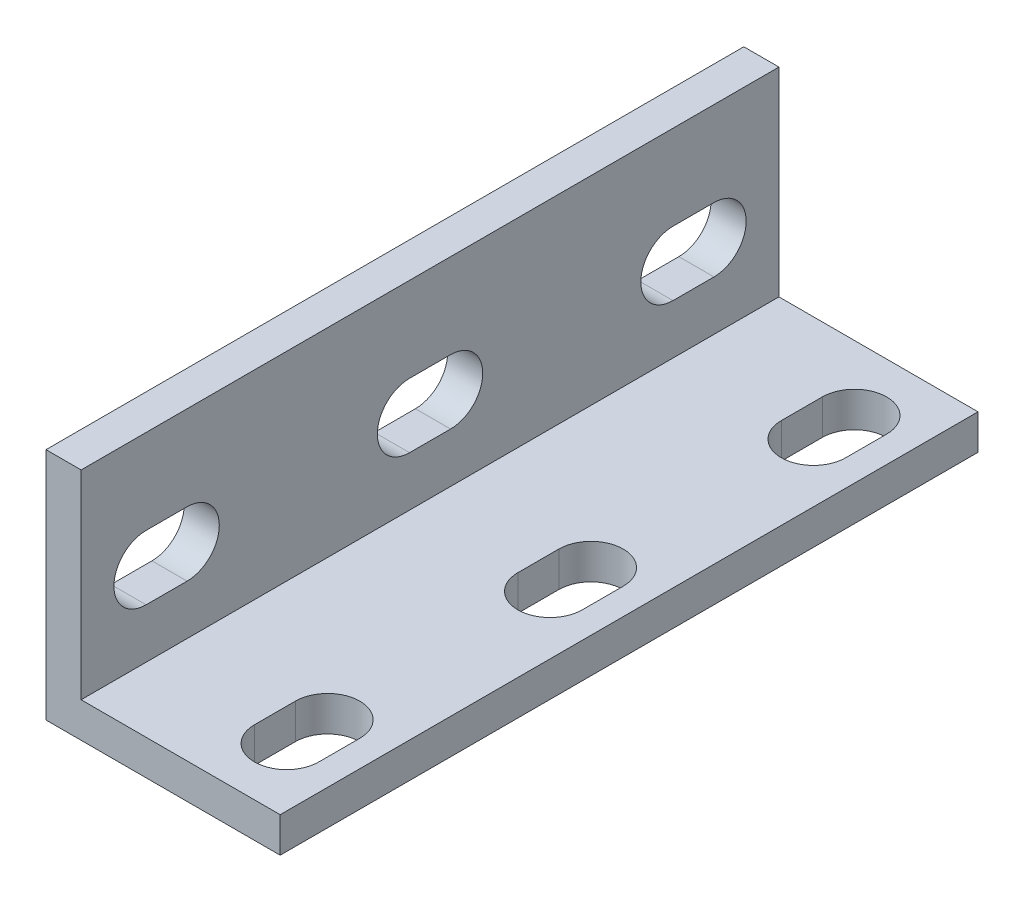
ISO-10303-21;
HEADER;
FILE_DESCRIPTION(('STEP AP214'),'2;1');
FILE_NAME('part.step','',(''),(''),'','','');
FILE_SCHEMA(('AUTOMOTIVE_DESIGN { 1 0 10303 214 1 1 1 1 }'));
ENDSEC;
DATA;
#1=APPLICATION_CONTEXT('core data for automotive mechanical design processes');
#2=APPLICATION_PROTOCOL_DEFINITION('international standard','automotive_design',2000,#1);
#3=PRODUCT_CONTEXT('',#1,'mechanical');
#4=PRODUCT('Part','Part','',(#3));
#5=PRODUCT_RELATED_PRODUCT_CATEGORY('part','',(#4));
#6=PRODUCT_DEFINITION_FORMATION('','',#4);
#7=PRODUCT_DEFINITION_CONTEXT('part definition',#1,'design');
#8=PRODUCT_DEFINITION('design','',#6,#7);
#9=PRODUCT_DEFINITION_SHAPE('','',#8);
#10=(LENGTH_UNIT() NAMED_UNIT(*) SI_UNIT(.MILLI.,.METRE.));
#11=(NAMED_UNIT(*) PLANE_ANGLE_UNIT() SI_UNIT($,.RADIAN.));
#12=(NAMED_UNIT(*) SI_UNIT($,.STERADIAN.) SOLID_ANGLE_UNIT());
#13=UNCERTAINTY_MEASURE_WITH_UNIT(LENGTH_MEASURE(1.E-05),#10,'distance_accuracy_value','');
#14=(GEOMETRIC_REPRESENTATION_CONTEXT(3) GLOBAL_UNCERTAINTY_ASSIGNED_CONTEXT((#13)) GLOBAL_UNIT_ASSIGNED_CONTEXT((#10,
#11,#12)) REPRESENTATION_CONTEXT('',''));
#15=CARTESIAN_POINT('',(0.,0.,0.));
#16=DIRECTION('',(0.,0.,1.));
#17=DIRECTION('',(1.,0.,0.));
#18=AXIS2_PLACEMENT_3D('',#15,#16,#17);
#19=CARTESIAN_POINT('',(0.,0.,59.6));
#20=DIRECTION('',(0.,1.,0.));
#21=DIRECTION('',(0.,0.,1.));
#22=AXIS2_PLACEMENT_3D('',#19,#20,#21);
#23=PLANE('',#22);
#24=DIRECTION('',(0.,0.,-1.));
#25=VECTOR('',#24,1.);
#26=CARTESIAN_POINT('',(17.75,0.,28.05));
#27=LINE('',#26,#25);
#28=CARTESIAN_POINT('',(17.75,0.,31.55));
#29=VERTEX_POINT('',#28);
#30=CARTESIAN_POINT('',(17.75,0.,28.05));
#31=VERTEX_POINT('',#30);
#32=EDGE_CURVE('E238',#29,#31,#27,.T.);
#33=ORIENTED_EDGE('',*,*,#32,.T.);
#34=CARTESIAN_POINT('',(15.,0.,28.05));
#35=DIRECTION('',(0.,1.,0.));
#36=DIRECTION('',(0.,0.,1.));
#37=AXIS2_PLACEMENT_3D('',#34,#35,#36);
#38=CIRCLE('',#37,2.75000000000001);
#39=CARTESIAN_POINT('',(12.25,0.,28.05));
#40=VERTEX_POINT('',#39);
#41=EDGE_CURVE('E232',#31,#40,#38,.T.);
#42=ORIENTED_EDGE('',*,*,#41,.T.);
#43=DIRECTION('',(0.,0.,1.));
#44=VECTOR('',#43,1.);
#45=CARTESIAN_POINT('',(12.25,0.,28.05));
#46=LINE('',#45,#44);
#47=CARTESIAN_POINT('',(12.25,0.,31.55));
#48=VERTEX_POINT('',#47);
#49=EDGE_CURVE('E241',#40,#48,#46,.T.);
#50=ORIENTED_EDGE('',*,*,#49,.T.);
#51=CARTESIAN_POINT('',(15.,0.,31.55));
#52=DIRECTION('',(0.,1.,0.));
#53=DIRECTION('',(0.,0.,1.));
#54=AXIS2_PLACEMENT_3D('',#51,#52,#53);
#55=CIRCLE('',#54,2.75000000000001);
#56=EDGE_CURVE('E49',#48,#29,#55,.T.);
#57=ORIENTED_EDGE('',*,*,#56,.T.);
#58=EDGE_LOOP('',(#33,#42,#50,#57));
#59=FACE_BOUND('',#58,.T.);
#60=DIRECTION('',(0.,0.,-1.));
#61=VECTOR('',#60,1.);
#62=CARTESIAN_POINT('',(17.75,0.,5.54999999999999));
#63=LINE('',#62,#61);
#64=CARTESIAN_POINT('',(17.75,0.,9.05000000000001));
#65=VERTEX_POINT('',#64);
#66=CARTESIAN_POINT('',(17.75,0.,5.54999999999999));
#67=VERTEX_POINT('',#66);
#68=EDGE_CURVE('E276',#65,#67,#63,.T.);
#69=ORIENTED_EDGE('',*,*,#68,.T.);
#70=CARTESIAN_POINT('',(15.,0.,5.55));
#71=DIRECTION('',(0.,1.,0.));
#72=DIRECTION('',(0.,0.,-1.));
#73=AXIS2_PLACEMENT_3D('',#70,#71,#72);
#74=CIRCLE('',#73,2.75000000000001);
#75=CARTESIAN_POINT('',(12.25,0.,5.54999999999999));
#76=VERTEX_POINT('',#75);
#77=EDGE_CURVE('E266',#67,#76,#74,.T.);
#78=ORIENTED_EDGE('',*,*,#77,.T.);
#79=DIRECTION('',(0.,0.,1.));
#80=VECTOR('',#79,1.);
#81=CARTESIAN_POINT('',(12.25,0.,5.54999999999999));
#82=LINE('',#81,#80);
#83=CARTESIAN_POINT('',(12.25,0.,9.05));
#84=VERTEX_POINT('',#83);
#85=EDGE_CURVE('E269',#76,#84,#82,.T.);
#86=ORIENTED_EDGE('',*,*,#85,.T.);
#87=CARTESIAN_POINT('',(15.,0.,9.05));
#88=DIRECTION('',(0.,1.,0.));
#89=DIRECTION('',(0.,0.,-1.));
#90=AXIS2_PLACEMENT_3D('',#87,#88,#89);
#91=CIRCLE('',#90,2.75000000000001);
#92=EDGE_CURVE('E273',#84,#65,#91,.T.);
#93=ORIENTED_EDGE('',*,*,#92,.T.);
#94=EDGE_LOOP('',(#69,#78,#86,#93));
#95=FACE_BOUND('',#94,.T.);
#96=DIRECTION('',(0.,0.,1.));
#97=VECTOR('',#96,1.);
#98=CARTESIAN_POINT('',(12.25,0.,54.05));
#99=LINE('',#98,#97);
#100=CARTESIAN_POINT('',(12.25,0.,50.55));
#101=VERTEX_POINT('',#100);
#102=CARTESIAN_POINT('',(12.25,0.,54.05));
#103=VERTEX_POINT('',#102);
#104=EDGE_CURVE('E308',#101,#103,#99,.T.);
#105=ORIENTED_EDGE('',*,*,#104,.T.);
#106=CARTESIAN_POINT('',(15.,0.,54.05));
#107=DIRECTION('',(0.,1.,0.));
#108=DIRECTION('',(0.,0.,1.));
#109=AXIS2_PLACEMENT_3D('',#106,#107,#108);
#110=CIRCLE('',#109,2.75000000000001);
#111=CARTESIAN_POINT('',(17.75,0.,54.05));
#112=VERTEX_POINT('',#111);
#113=EDGE_CURVE('E298',#103,#112,#110,.T.);
#114=ORIENTED_EDGE('',*,*,#113,.T.);
#115=DIRECTION('',(0.,0.,-1.));
#116=VECTOR('',#115,1.);
#117=CARTESIAN_POINT('',(17.75,0.,54.05));
#118=LINE('',#117,#116);
#119=CARTESIAN_POINT('',(17.75,0.,50.55));
#120=VERTEX_POINT('',#119);
#121=EDGE_CURVE('E301',#112,#120,#118,.T.);
#122=ORIENTED_EDGE('',*,*,#121,.T.);
#123=CARTESIAN_POINT('',(15.,0.,50.55));
#124=DIRECTION('',(0.,1.,0.));
#125=DIRECTION('',(0.,0.,1.));
#126=AXIS2_PLACEMENT_3D('',#123,#124,#125);
#127=CIRCLE('',#126,2.75000000000001);
#128=EDGE_CURVE('E305',#120,#101,#127,.T.);
#129=ORIENTED_EDGE('',*,*,#128,.T.);
#130=EDGE_LOOP('',(#105,#114,#122,#129));
#131=FACE_BOUND('',#130,.T.);
#132=DIRECTION('',(1.,0.,0.));
#133=VECTOR('',#132,1.);
#134=CARTESIAN_POINT('',(0.,0.,0.));
#135=LINE('',#134,#133);
#136=CARTESIAN_POINT('',(0.,0.,0.));
#137=VERTEX_POINT('',#136);
#138=CARTESIAN_POINT('',(20.,0.,0.));
#139=VERTEX_POINT('',#138);
#140=EDGE_CURVE('E419',#137,#139,#135,.T.);
#141=ORIENTED_EDGE('',*,*,#140,.T.);
#142=DIRECTION('',(0.,0.,-1.));
#143=VECTOR('',#142,1.);
#144=CARTESIAN_POINT('',(20.,0.,59.6));
#145=LINE('',#144,#143);
#146=CARTESIAN_POINT('',(20.,0.,59.6));
#147=VERTEX_POINT('',#146);
#148=EDGE_CURVE('E11',#147,#139,#145,.T.);
#149=ORIENTED_EDGE('',*,*,#148,.F.);
#150=DIRECTION('',(1.,0.,0.));
#151=VECTOR('',#150,1.);
#152=CARTESIAN_POINT('',(0.,0.,59.6));
#153=LINE('',#152,#151);
#154=CARTESIAN_POINT('',(0.,0.,59.6));
#155=VERTEX_POINT('',#154);
#156=EDGE_CURVE('E426',#155,#147,#153,.T.);
#157=ORIENTED_EDGE('',*,*,#156,.F.);
#158=DIRECTION('',(0.,0.,-1.));
#159=VECTOR('',#158,1.);
#160=CARTESIAN_POINT('',(0.,0.,59.6));
#161=LINE('',#160,#159);
#162=EDGE_CURVE('E443',#155,#137,#161,.T.);
#163=ORIENTED_EDGE('',*,*,#162,.T.);
#164=EDGE_LOOP('',(#141,#149,#157,#163));
#165=FACE_BOUND('',#164,.T.);
#166=ADVANCED_FACE('F35',(#59,#95,#131,#165),#23,.F.);
#167=CARTESIAN_POINT('',(20.,3.,59.6));
#168=DIRECTION('',(1.,0.,0.));
#169=DIRECTION('',(0.,0.,-1.));
#170=AXIS2_PLACEMENT_3D('',#167,#168,#169);
#171=PLANE('',#170);
#172=DIRECTION('',(0.,-1.,0.));
#173=VECTOR('',#172,1.);
#174=CARTESIAN_POINT('',(20.,3.,0.));
#175=LINE('',#174,#173);
#176=CARTESIAN_POINT('',(20.,3.,0.));
#177=VERTEX_POINT('',#176);
#178=EDGE_CURVE('E446',#177,#139,#175,.T.);
#179=ORIENTED_EDGE('',*,*,#178,.F.);
#180=DIRECTION('',(0.,0.,-1.));
#181=VECTOR('',#180,1.);
#182=CARTESIAN_POINT('',(20.,3.,59.6));
#183=LINE('',#182,#181);
#184=CARTESIAN_POINT('',(20.,3.,59.6));
#185=VERTEX_POINT('',#184);
#186=EDGE_CURVE('E42',#185,#177,#183,.T.);
#187=ORIENTED_EDGE('',*,*,#186,.F.);
#188=DIRECTION('',(0.,-1.,0.));
#189=VECTOR('',#188,1.);
#190=CARTESIAN_POINT('',(20.,3.,59.6));
#191=LINE('',#190,#189);
#192=EDGE_CURVE('E428',#185,#147,#191,.T.);
#193=ORIENTED_EDGE('',*,*,#192,.T.);
#194=ORIENTED_EDGE('',*,*,#148,.T.);
#195=EDGE_LOOP('',(#179,#187,#193,#194));
#196=FACE_BOUND('',#195,.T.);
#197=ADVANCED_FACE('F473',(#196),#171,.T.);
#198=CARTESIAN_POINT('',(0.,3.,59.6));
#199=DIRECTION('',(0.,1.,0.));
#200=DIRECTION('',(0.,0.,1.));
#201=AXIS2_PLACEMENT_3D('',#198,#199,#200);
#202=PLANE('',#201);
#203=CARTESIAN_POINT('',(15.,3.,28.05));
#204=DIRECTION('',(0.,1.,0.));
#205=DIRECTION('',(0.,0.,1.));
#206=AXIS2_PLACEMENT_3D('',#203,#204,#205);
#207=CIRCLE('',#206,2.75000000000001);
#208=CARTESIAN_POINT('',(17.75,3.,28.05));
#209=VERTEX_POINT('',#208);
#210=CARTESIAN_POINT('',(12.25,3.,28.05));
#211=VERTEX_POINT('',#210);
#212=EDGE_CURVE('E57',#209,#211,#207,.T.);
#213=ORIENTED_EDGE('',*,*,#212,.F.);
#214=DIRECTION('',(0.,0.,-1.));
#215=VECTOR('',#214,1.);
#216=CARTESIAN_POINT('',(17.75,3.,28.05));
#217=LINE('',#216,#215);
#218=CARTESIAN_POINT('',(17.75,3.,31.55));
#219=VERTEX_POINT('',#218);
#220=EDGE_CURVE('E247',#219,#209,#217,.T.);
#221=ORIENTED_EDGE('',*,*,#220,.F.);
#222=CARTESIAN_POINT('',(15.,3.,31.55));
#223=DIRECTION('',(0.,1.,0.));
#224=DIRECTION('',(0.,0.,1.));
#225=AXIS2_PLACEMENT_3D('',#222,#223,#224);
#226=CIRCLE('',#225,2.75000000000001);
#227=CARTESIAN_POINT('',(12.25,3.,31.55));
#228=VERTEX_POINT('',#227);
#229=EDGE_CURVE('E250',#228,#219,#226,.T.);
#230=ORIENTED_EDGE('',*,*,#229,.F.);
#231=DIRECTION('',(0.,0.,1.));
#232=VECTOR('',#231,1.);
#233=CARTESIAN_POINT('',(12.25,3.,28.05));
#234=LINE('',#233,#232);
#235=EDGE_CURVE('E256',#211,#228,#234,.T.);
#236=ORIENTED_EDGE('',*,*,#235,.F.);
#237=EDGE_LOOP('',(#213,#221,#230,#236));
#238=FACE_BOUND('',#237,.T.);
#239=CARTESIAN_POINT('',(15.,3.,5.55));
#240=DIRECTION('',(0.,1.,0.));
#241=DIRECTION('',(0.,0.,-1.));
#242=AXIS2_PLACEMENT_3D('',#239,#240,#241);
#243=CIRCLE('',#242,2.75000000000001);
#244=CARTESIAN_POINT('',(17.75,3.,5.54999999999999));
#245=VERTEX_POINT('',#244);
#246=CARTESIAN_POINT('',(12.25,3.,5.54999999999999));
#247=VERTEX_POINT('',#246);
#248=EDGE_CURVE('E262',#245,#247,#243,.T.);
#249=ORIENTED_EDGE('',*,*,#248,.F.);
#250=DIRECTION('',(0.,0.,-1.));
#251=VECTOR('',#250,1.);
#252=CARTESIAN_POINT('',(17.75,3.,5.54999999999999));
#253=LINE('',#252,#251);
#254=CARTESIAN_POINT('',(17.75,3.,9.05000000000001));
#255=VERTEX_POINT('',#254);
#256=EDGE_CURVE('E270',#255,#245,#253,.T.);
#257=ORIENTED_EDGE('',*,*,#256,.F.);
#258=CARTESIAN_POINT('',(15.,3.,9.05));
#259=DIRECTION('',(0.,1.,0.));
#260=DIRECTION('',(0.,0.,-1.));
#261=AXIS2_PLACEMENT_3D('',#258,#259,#260);
#262=CIRCLE('',#261,2.75000000000001);
#263=CARTESIAN_POINT('',(12.25,3.,9.05000000000001));
#264=VERTEX_POINT('',#263);
#265=EDGE_CURVE('E284',#264,#255,#262,.T.);
#266=ORIENTED_EDGE('',*,*,#265,.F.);
#267=DIRECTION('',(0.,0.,1.));
#268=VECTOR('',#267,1.);
#269=CARTESIAN_POINT('',(12.25,3.,5.54999999999999));
#270=LINE('',#269,#268);
#271=EDGE_CURVE('E281',#247,#264,#270,.T.);
#272=ORIENTED_EDGE('',*,*,#271,.F.);
#273=EDGE_LOOP('',(#249,#257,#266,#272));
#274=FACE_BOUND('',#273,.T.);
#275=CARTESIAN_POINT('',(15.,3.,54.05));
#276=DIRECTION('',(0.,1.,0.));
#277=DIRECTION('',(0.,0.,1.));
#278=AXIS2_PLACEMENT_3D('',#275,#276,#277);
#279=CIRCLE('',#278,2.75000000000001);
#280=CARTESIAN_POINT('',(12.25,3.,54.05));
#281=VERTEX_POINT('',#280);
#282=CARTESIAN_POINT('',(17.75,3.,54.05));
#283=VERTEX_POINT('',#282);
#284=EDGE_CURVE('E291',#281,#283,#279,.T.);
#285=ORIENTED_EDGE('',*,*,#284,.F.);
#286=DIRECTION('',(0.,0.,1.));
#287=VECTOR('',#286,1.);
#288=CARTESIAN_POINT('',(12.25,3.,54.05));
#289=LINE('',#288,#287);
#290=CARTESIAN_POINT('',(12.25,3.,50.55));
#291=VERTEX_POINT('',#290);
#292=EDGE_CURVE('E302',#291,#281,#289,.T.);
#293=ORIENTED_EDGE('',*,*,#292,.F.);
#294=CARTESIAN_POINT('',(15.,3.,50.55));
#295=DIRECTION('',(0.,1.,0.));
#296=DIRECTION('',(0.,0.,1.));
#297=AXIS2_PLACEMENT_3D('',#294,#295,#296);
#298=CIRCLE('',#297,2.75000000000001);
#299=CARTESIAN_POINT('',(17.75,3.,50.55));
#300=VERTEX_POINT('',#299);
#301=EDGE_CURVE('E316',#300,#291,#298,.T.);
#302=ORIENTED_EDGE('',*,*,#301,.F.);
#303=DIRECTION('',(0.,0.,-1.));
#304=VECTOR('',#303,1.);
#305=CARTESIAN_POINT('',(17.75,3.,54.05));
#306=LINE('',#305,#304);
#307=EDGE_CURVE('E313',#283,#300,#306,.T.);
#308=ORIENTED_EDGE('',*,*,#307,.F.);
#309=EDGE_LOOP('',(#285,#293,#302,#308));
#310=FACE_BOUND('',#309,.T.);
#311=DIRECTION('',(1.,0.,0.));
#312=VECTOR('',#311,1.);
#313=CARTESIAN_POINT('',(0.,3.,0.));
#314=LINE('',#313,#312);
#315=CARTESIAN_POINT('',(3.,3.,0.));
#316=VERTEX_POINT('',#315);
#317=EDGE_CURVE('E449',#316,#177,#314,.T.);
#318=ORIENTED_EDGE('',*,*,#317,.F.);
#319=DIRECTION('',(0.,0.,-1.));
#320=VECTOR('',#319,1.);
#321=CARTESIAN_POINT('',(3.,3.,59.6));
#322=LINE('',#321,#320);
#323=CARTESIAN_POINT('',(3.,3.,59.6));
#324=VERTEX_POINT('',#323);
#325=EDGE_CURVE('E465',#324,#316,#322,.T.);
#326=ORIENTED_EDGE('',*,*,#325,.F.);
#327=DIRECTION('',(1.,0.,0.));
#328=VECTOR('',#327,1.);
#329=CARTESIAN_POINT('',(0.,3.,59.6));
#330=LINE('',#329,#328);
#331=EDGE_CURVE('E432',#324,#185,#330,.T.);
#332=ORIENTED_EDGE('',*,*,#331,.T.);
#333=ORIENTED_EDGE('',*,*,#186,.T.);
#334=EDGE_LOOP('',(#318,#326,#332,#333));
#335=FACE_BOUND('',#334,.T.);
#336=ADVANCED_FACE('F469',(#238,#274,#310,#335),#202,.T.);
#337=CARTESIAN_POINT('',(3.,20.,59.6));
#338=DIRECTION('',(1.,0.,0.));
#339=DIRECTION('',(0.,0.,-1.));
#340=AXIS2_PLACEMENT_3D('',#337,#338,#339);
#341=PLANE('',#340);
#342=CARTESIAN_POINT('',(3.,10.,28.05));
#343=DIRECTION('',(1.,0.,0.));
#344=DIRECTION('',(0.,0.,-1.));
#345=AXIS2_PLACEMENT_3D('',#342,#343,#344);
#346=CIRCLE('',#345,2.74999999999999);
#347=CARTESIAN_POINT('',(3.,7.25000000000001,28.05));
#348=VERTEX_POINT('',#347);
#349=CARTESIAN_POINT('',(3.,12.75,28.05));
#350=VERTEX_POINT('',#349);
#351=EDGE_CURVE('E323',#348,#350,#346,.T.);
#352=ORIENTED_EDGE('',*,*,#351,.F.);
#353=DIRECTION('',(0.,0.,-1.));
#354=VECTOR('',#353,1.);
#355=CARTESIAN_POINT('',(3.,7.25000000000001,28.05));
#356=LINE('',#355,#354);
#357=CARTESIAN_POINT('',(3.,7.25000000000001,31.55));
#358=VERTEX_POINT('',#357);
#359=EDGE_CURVE('E334',#358,#348,#356,.T.);
#360=ORIENTED_EDGE('',*,*,#359,.F.);
#361=CARTESIAN_POINT('',(3.,10.,31.55));
#362=DIRECTION('',(1.,0.,0.));
#363=DIRECTION('',(0.,0.,-1.));
#364=AXIS2_PLACEMENT_3D('',#361,#362,#363);
#365=CIRCLE('',#364,2.74999999999999);
#366=CARTESIAN_POINT('',(3.,12.75,31.55));
#367=VERTEX_POINT('',#366);
#368=EDGE_CURVE('E348',#367,#358,#365,.T.);
#369=ORIENTED_EDGE('',*,*,#368,.F.);
#370=DIRECTION('',(0.,0.,1.));
#371=VECTOR('',#370,1.);
#372=CARTESIAN_POINT('',(3.,12.75,28.05));
#373=LINE('',#372,#371);
#374=EDGE_CURVE('E345',#350,#367,#373,.T.);
#375=ORIENTED_EDGE('',*,*,#374,.F.);
#376=EDGE_LOOP('',(#352,#360,#369,#375));
#377=FACE_BOUND('',#376,.T.);
#378=CARTESIAN_POINT('',(3.,10.,9.04999999999998));
#379=DIRECTION('',(1.,0.,0.));
#380=DIRECTION('',(0.,0.,1.));
#381=AXIS2_PLACEMENT_3D('',#378,#379,#380);
#382=CIRCLE('',#381,2.75);
#383=CARTESIAN_POINT('',(3.,12.75,9.05000000000001));
#384=VERTEX_POINT('',#383);
#385=CARTESIAN_POINT('',(3.,7.25000000000001,9.05000000000001));
#386=VERTEX_POINT('',#385);
#387=EDGE_CURVE('E355',#384,#386,#382,.T.);
#388=ORIENTED_EDGE('',*,*,#387,.F.);
#389=DIRECTION('',(0.,0.,1.));
#390=VECTOR('',#389,1.);
#391=CARTESIAN_POINT('',(3.,12.75,9.05000000000001));
#392=LINE('',#391,#390);
#393=CARTESIAN_POINT('',(3.,12.75,5.54999999999992));
#394=VERTEX_POINT('',#393);
#395=EDGE_CURVE('E366',#394,#384,#392,.T.);
#396=ORIENTED_EDGE('',*,*,#395,.F.);
#397=CARTESIAN_POINT('',(3.,10.,5.54999999999998));
#398=DIRECTION('',(1.,0.,0.));
#399=DIRECTION('',(0.,0.,1.));
#400=AXIS2_PLACEMENT_3D('',#397,#398,#399);
#401=CIRCLE('',#400,2.75);
#402=CARTESIAN_POINT('',(3.,7.25000000000001,5.54999999999992));
#403=VERTEX_POINT('',#402);
#404=EDGE_CURVE('E380',#403,#394,#401,.T.);
#405=ORIENTED_EDGE('',*,*,#404,.F.);
#406=DIRECTION('',(0.,0.,-1.));
#407=VECTOR('',#406,1.);
#408=CARTESIAN_POINT('',(3.,7.25000000000001,9.05000000000001));
#409=LINE('',#408,#407);
#410=EDGE_CURVE('E377',#386,#403,#409,.T.);
#411=ORIENTED_EDGE('',*,*,#410,.F.);
#412=EDGE_LOOP('',(#388,#396,#405,#411));
#413=FACE_BOUND('',#412,.T.);
#414=CARTESIAN_POINT('',(3.,10.,50.5500000000001));
#415=DIRECTION('',(1.,0.,0.));
#416=DIRECTION('',(0.,0.,-1.));
#417=AXIS2_PLACEMENT_3D('',#414,#415,#416);
#418=CIRCLE('',#417,2.75);
#419=CARTESIAN_POINT('',(3.,7.25,50.55));
#420=VERTEX_POINT('',#419);
#421=CARTESIAN_POINT('',(3.,12.75,50.55));
#422=VERTEX_POINT('',#421);
#423=EDGE_CURVE('E387',#420,#422,#418,.T.);
#424=ORIENTED_EDGE('',*,*,#423,.F.);
#425=DIRECTION('',(0.,0.,-1.));
#426=VECTOR('',#425,1.);
#427=CARTESIAN_POINT('',(3.,7.25,50.55));
#428=LINE('',#427,#426);
#429=CARTESIAN_POINT('',(3.,7.25,54.0500000000001));
#430=VERTEX_POINT('',#429);
#431=EDGE_CURVE('E398',#430,#420,#428,.T.);
#432=ORIENTED_EDGE('',*,*,#431,.F.);
#433=CARTESIAN_POINT('',(3.,10.,54.0500000000001));
#434=DIRECTION('',(1.,0.,0.));
#435=DIRECTION('',(0.,0.,-1.));
#436=AXIS2_PLACEMENT_3D('',#433,#434,#435);
#437=CIRCLE('',#436,2.75);
#438=CARTESIAN_POINT('',(3.,12.75,54.0500000000001));
#439=VERTEX_POINT('',#438);
#440=EDGE_CURVE('E412',#439,#430,#437,.T.);
#441=ORIENTED_EDGE('',*,*,#440,.F.);
#442=DIRECTION('',(0.,0.,1.));
#443=VECTOR('',#442,1.);
#444=CARTESIAN_POINT('',(3.,12.75,50.55));
#445=LINE('',#444,#443);
#446=EDGE_CURVE('E409',#422,#439,#445,.T.);
#447=ORIENTED_EDGE('',*,*,#446,.F.);
#448=EDGE_LOOP('',(#424,#432,#441,#447));
#449=FACE_BOUND('',#448,.T.);
#450=DIRECTION('',(0.,1.,0.));
#451=VECTOR('',#450,1.);
#452=CARTESIAN_POINT('',(3.,20.,0.));
#453=LINE('',#452,#451);
#454=CARTESIAN_POINT('',(3.,20.,0.));
#455=VERTEX_POINT('',#454);
#456=EDGE_CURVE('E452',#455,#316,#453,.F.);
#457=ORIENTED_EDGE('',*,*,#456,.F.);
#458=DIRECTION('',(0.,0.,-1.));
#459=VECTOR('',#458,1.);
#460=CARTESIAN_POINT('',(3.,20.,59.6));
#461=LINE('',#460,#459);
#462=CARTESIAN_POINT('',(3.,20.,59.6));
#463=VERTEX_POINT('',#462);
#464=EDGE_CURVE('E463',#463,#455,#461,.T.);
#465=ORIENTED_EDGE('',*,*,#464,.F.);
#466=DIRECTION('',(0.,1.,0.));
#467=VECTOR('',#466,1.);
#468=CARTESIAN_POINT('',(3.,20.,59.6));
#469=LINE('',#468,#467);
#470=EDGE_CURVE('E435',#463,#324,#469,.F.);
#471=ORIENTED_EDGE('',*,*,#470,.T.);
#472=ORIENTED_EDGE('',*,*,#325,.T.);
#473=EDGE_LOOP('',(#457,#465,#471,#472));
#474=FACE_BOUND('',#473,.T.);
#475=ADVANCED_FACE('F482',(#377,#413,#449,#474),#341,.T.);
#476=CARTESIAN_POINT('',(0.,20.,59.6));
#477=DIRECTION('',(0.,1.,0.));
#478=DIRECTION('',(0.,0.,1.));
#479=AXIS2_PLACEMENT_3D('',#476,#477,#478);
#480=PLANE('',#479);
#481=DIRECTION('',(1.,0.,0.));
#482=VECTOR('',#481,1.);
#483=CARTESIAN_POINT('',(0.,20.,0.));
#484=LINE('',#483,#482);
#485=CARTESIAN_POINT('',(0.,20.,0.));
#486=VERTEX_POINT('',#485);
#487=EDGE_CURVE('E455',#486,#455,#484,.T.);
#488=ORIENTED_EDGE('',*,*,#487,.F.);
#489=DIRECTION('',(0.,0.,-1.));
#490=VECTOR('',#489,1.);
#491=CARTESIAN_POINT('',(0.,20.,59.6));
#492=LINE('',#491,#490);
#493=CARTESIAN_POINT('',(0.,20.,59.6));
#494=VERTEX_POINT('',#493);
#495=EDGE_CURVE('E461',#494,#486,#492,.T.);
#496=ORIENTED_EDGE('',*,*,#495,.F.);
#497=DIRECTION('',(1.,0.,0.));
#498=VECTOR('',#497,1.);
#499=CARTESIAN_POINT('',(0.,20.,59.6));
#500=LINE('',#499,#498);
#501=EDGE_CURVE('E438',#494,#463,#500,.T.);
#502=ORIENTED_EDGE('',*,*,#501,.T.);
#503=ORIENTED_EDGE('',*,*,#464,.T.);
#504=EDGE_LOOP('',(#488,#496,#502,#503));
#505=FACE_BOUND('',#504,.T.);
#506=ADVANCED_FACE('F493',(#505),#480,.T.);
#507=CARTESIAN_POINT('',(0.,20.,59.6));
#508=DIRECTION('',(1.,0.,0.));
#509=DIRECTION('',(0.,0.,-1.));
#510=AXIS2_PLACEMENT_3D('',#507,#508,#509);
#511=PLANE('',#510);
#512=DIRECTION('',(0.,0.,-1.));
#513=VECTOR('',#512,1.);
#514=CARTESIAN_POINT('',(0.,7.25000000000001,28.05));
#515=LINE('',#514,#513);
#516=CARTESIAN_POINT('',(0.,7.25000000000001,31.55));
#517=VERTEX_POINT('',#516);
#518=CARTESIAN_POINT('',(0.,7.25000000000001,28.05));
#519=VERTEX_POINT('',#518);
#520=EDGE_CURVE('E340',#517,#519,#515,.T.);
#521=ORIENTED_EDGE('',*,*,#520,.T.);
#522=CARTESIAN_POINT('',(0.,10.,28.05));
#523=DIRECTION('',(1.,0.,0.));
#524=DIRECTION('',(0.,0.,-1.));
#525=AXIS2_PLACEMENT_3D('',#522,#523,#524);
#526=CIRCLE('',#525,2.74999999999999);
#527=CARTESIAN_POINT('',(0.,12.75,28.05));
#528=VERTEX_POINT('',#527);
#529=EDGE_CURVE('E330',#519,#528,#526,.T.);
#530=ORIENTED_EDGE('',*,*,#529,.T.);
#531=DIRECTION('',(0.,0.,1.));
#532=VECTOR('',#531,1.);
#533=CARTESIAN_POINT('',(0.,12.75,28.05));
#534=LINE('',#533,#532);
#535=CARTESIAN_POINT('',(0.,12.75,31.55));
#536=VERTEX_POINT('',#535);
#537=EDGE_CURVE('E333',#528,#536,#534,.T.);
#538=ORIENTED_EDGE('',*,*,#537,.T.);
#539=CARTESIAN_POINT('',(0.,10.,31.55));
#540=DIRECTION('',(1.,0.,0.));
#541=DIRECTION('',(0.,0.,-1.));
#542=AXIS2_PLACEMENT_3D('',#539,#540,#541);
#543=CIRCLE('',#542,2.74999999999999);
#544=EDGE_CURVE('E337',#536,#517,#543,.T.);
#545=ORIENTED_EDGE('',*,*,#544,.T.);
#546=EDGE_LOOP('',(#521,#530,#538,#545));
#547=FACE_BOUND('',#546,.T.);
#548=DIRECTION('',(0.,0.,1.));
#549=VECTOR('',#548,1.);
#550=CARTESIAN_POINT('',(0.,12.75,9.05000000000001));
#551=LINE('',#550,#549);
#552=CARTESIAN_POINT('',(0.,12.75,5.54999999999992));
#553=VERTEX_POINT('',#552);
#554=CARTESIAN_POINT('',(0.,12.75,9.05000000000001));
#555=VERTEX_POINT('',#554);
#556=EDGE_CURVE('E372',#553,#555,#551,.T.);
#557=ORIENTED_EDGE('',*,*,#556,.T.);
#558=CARTESIAN_POINT('',(0.,10.,9.04999999999998));
#559=DIRECTION('',(1.,0.,0.));
#560=DIRECTION('',(0.,0.,1.));
#561=AXIS2_PLACEMENT_3D('',#558,#559,#560);
#562=CIRCLE('',#561,2.75);
#563=CARTESIAN_POINT('',(0.,7.25000000000001,9.05000000000001));
#564=VERTEX_POINT('',#563);
#565=EDGE_CURVE('E362',#555,#564,#562,.T.);
#566=ORIENTED_EDGE('',*,*,#565,.T.);
#567=DIRECTION('',(0.,0.,-1.));
#568=VECTOR('',#567,1.);
#569=CARTESIAN_POINT('',(0.,7.25000000000001,9.05000000000001));
#570=LINE('',#569,#568);
#571=CARTESIAN_POINT('',(0.,7.25000000000001,5.54999999999992));
#572=VERTEX_POINT('',#571);
#573=EDGE_CURVE('E365',#564,#572,#570,.T.);
#574=ORIENTED_EDGE('',*,*,#573,.T.);
#575=CARTESIAN_POINT('',(0.,10.,5.54999999999998));
#576=DIRECTION('',(1.,0.,0.));
#577=DIRECTION('',(0.,0.,1.));
#578=AXIS2_PLACEMENT_3D('',#575,#576,#577);
#579=CIRCLE('',#578,2.75);
#580=EDGE_CURVE('E369',#572,#553,#579,.T.);
#581=ORIENTED_EDGE('',*,*,#580,.T.);
#582=EDGE_LOOP('',(#557,#566,#574,#581));
#583=FACE_BOUND('',#582,.T.);
#584=DIRECTION('',(0.,0.,-1.));
#585=VECTOR('',#584,1.);
#586=CARTESIAN_POINT('',(0.,7.25,50.55));
#587=LINE('',#586,#585);
#588=CARTESIAN_POINT('',(0.,7.25,54.0500000000001));
#589=VERTEX_POINT('',#588);
#590=CARTESIAN_POINT('',(0.,7.25,50.55));
#591=VERTEX_POINT('',#590);
#592=EDGE_CURVE('E404',#589,#591,#587,.T.);
#593=ORIENTED_EDGE('',*,*,#592,.T.);
#594=CARTESIAN_POINT('',(0.,10.,50.5500000000001));
#595=DIRECTION('',(1.,0.,0.));
#596=DIRECTION('',(0.,0.,-1.));
#597=AXIS2_PLACEMENT_3D('',#594,#595,#596);
#598=CIRCLE('',#597,2.75);
#599=CARTESIAN_POINT('',(0.,12.75,50.55));
#600=VERTEX_POINT('',#599);
#601=EDGE_CURVE('E394',#591,#600,#598,.T.);
#602=ORIENTED_EDGE('',*,*,#601,.T.);
#603=DIRECTION('',(0.,0.,1.));
#604=VECTOR('',#603,1.);
#605=CARTESIAN_POINT('',(0.,12.75,50.55));
#606=LINE('',#605,#604);
#607=CARTESIAN_POINT('',(0.,12.75,54.0500000000001));
#608=VERTEX_POINT('',#607);
#609=EDGE_CURVE('E397',#600,#608,#606,.T.);
#610=ORIENTED_EDGE('',*,*,#609,.T.);
#611=CARTESIAN_POINT('',(0.,10.,54.0500000000001));
#612=DIRECTION('',(1.,0.,0.));
#613=DIRECTION('',(0.,0.,-1.));
#614=AXIS2_PLACEMENT_3D('',#611,#612,#613);
#615=CIRCLE('',#614,2.75);
#616=EDGE_CURVE('E401',#608,#589,#615,.T.);
#617=ORIENTED_EDGE('',*,*,#616,.T.);
#618=EDGE_LOOP('',(#593,#602,#610,#617));
#619=FACE_BOUND('',#618,.T.);
#620=DIRECTION('',(0.,-1.,0.));
#621=VECTOR('',#620,1.);
#622=CARTESIAN_POINT('',(0.,20.,0.));
#623=LINE('',#622,#621);
#624=EDGE_CURVE('E429',#486,#137,#623,.T.);
#625=ORIENTED_EDGE('',*,*,#624,.T.);
#626=ORIENTED_EDGE('',*,*,#162,.F.);
#627=DIRECTION('',(0.,-1.,0.));
#628=VECTOR('',#627,1.);
#629=CARTESIAN_POINT('',(0.,20.,59.6));
#630=LINE('',#629,#628);
#631=EDGE_CURVE('E441',#494,#155,#630,.T.);
#632=ORIENTED_EDGE('',*,*,#631,.F.);
#633=ORIENTED_EDGE('',*,*,#495,.T.);
#634=EDGE_LOOP('',(#625,#626,#632,#633));
#635=FACE_BOUND('',#634,.T.);
#636=ADVANCED_FACE('F494',(#547,#583,#619,#635),#511,.F.);
#637=CARTESIAN_POINT('',(0.,0.,59.6));
#638=DIRECTION('',(0.,0.,-1.));
#639=DIRECTION('',(-1.,0.,0.));
#640=AXIS2_PLACEMENT_3D('',#637,#638,#639);
#641=PLANE('',#640);
#642=ORIENTED_EDGE('',*,*,#156,.T.);
#643=ORIENTED_EDGE('',*,*,#192,.F.);
#644=ORIENTED_EDGE('',*,*,#331,.F.);
#645=ORIENTED_EDGE('',*,*,#470,.F.);
#646=ORIENTED_EDGE('',*,*,#501,.F.);
#647=ORIENTED_EDGE('',*,*,#631,.T.);
#648=EDGE_LOOP('',(#642,#643,#644,#645,#646,#647));
#649=FACE_BOUND('',#648,.T.);
#650=ADVANCED_FACE('F485',(#649),#641,.F.);
#651=CARTESIAN_POINT('',(0.,0.,0.));
#652=DIRECTION('',(0.,0.,-1.));
#653=DIRECTION('',(-1.,0.,0.));
#654=AXIS2_PLACEMENT_3D('',#651,#652,#653);
#655=PLANE('',#654);
#656=ORIENTED_EDGE('',*,*,#140,.F.);
#657=ORIENTED_EDGE('',*,*,#624,.F.);
#658=ORIENTED_EDGE('',*,*,#487,.T.);
#659=ORIENTED_EDGE('',*,*,#456,.T.);
#660=ORIENTED_EDGE('',*,*,#317,.T.);
#661=ORIENTED_EDGE('',*,*,#178,.T.);
#662=EDGE_LOOP('',(#656,#657,#658,#659,#660,#661));
#663=FACE_BOUND('',#662,.T.);
#664=ADVANCED_FACE('F477',(#663),#655,.T.);
#665=CARTESIAN_POINT('',(0.,10.,50.5500000000001));
#666=DIRECTION('',(1.,0.,0.));
#667=DIRECTION('',(0.,0.,-1.));
#668=AXIS2_PLACEMENT_3D('',#665,#666,#667);
#669=CYLINDRICAL_SURFACE('',#668,2.75);
#670=ORIENTED_EDGE('',*,*,#423,.T.);
#671=DIRECTION('',(1.,0.,0.));
#672=VECTOR('',#671,1.);
#673=CARTESIAN_POINT('',(0.,12.75,50.55));
#674=LINE('',#673,#672);
#675=EDGE_CURVE('E407',#600,#422,#674,.T.);
#676=ORIENTED_EDGE('',*,*,#675,.F.);
#677=ORIENTED_EDGE('',*,*,#601,.F.);
#678=DIRECTION('',(1.,0.,0.));
#679=VECTOR('',#678,1.);
#680=CARTESIAN_POINT('',(0.,7.25,50.55));
#681=LINE('',#680,#679);
#682=EDGE_CURVE('E417',#591,#420,#681,.T.);
#683=ORIENTED_EDGE('',*,*,#682,.T.);
#684=EDGE_LOOP('',(#670,#676,#677,#683));
#685=FACE_BOUND('',#684,.T.);
#686=ADVANCED_FACE('F533',(#685),#669,.F.);
#687=CARTESIAN_POINT('',(0.,7.25,50.55));
#688=DIRECTION('',(0.,-1.,0.));
#689=DIRECTION('',(0.,0.,-1.));
#690=AXIS2_PLACEMENT_3D('',#687,#688,#689);
#691=PLANE('',#690);
#692=ORIENTED_EDGE('',*,*,#431,.T.);
#693=ORIENTED_EDGE('',*,*,#682,.F.);
#694=ORIENTED_EDGE('',*,*,#592,.F.);
#695=DIRECTION('',(1.,0.,0.));
#696=VECTOR('',#695,1.);
#697=CARTESIAN_POINT('',(0.,7.25,54.0500000000001));
#698=LINE('',#697,#696);
#699=EDGE_CURVE('E420',#589,#430,#698,.T.);
#700=ORIENTED_EDGE('',*,*,#699,.T.);
#701=EDGE_LOOP('',(#692,#693,#694,#700));
#702=FACE_BOUND('',#701,.T.);
#703=ADVANCED_FACE('F542',(#702),#691,.F.);
#704=CARTESIAN_POINT('',(0.,10.,54.0500000000001));
#705=DIRECTION('',(1.,0.,0.));
#706=DIRECTION('',(0.,0.,-1.));
#707=AXIS2_PLACEMENT_3D('',#704,#705,#706);
#708=CYLINDRICAL_SURFACE('',#707,2.75);
#709=ORIENTED_EDGE('',*,*,#440,.T.);
#710=ORIENTED_EDGE('',*,*,#699,.F.);
#711=ORIENTED_EDGE('',*,*,#616,.F.);
#712=DIRECTION('',(1.,0.,0.));
#713=VECTOR('',#712,1.);
#714=CARTESIAN_POINT('',(0.,12.75,54.0500000000001));
#715=LINE('',#714,#713);
#716=EDGE_CURVE('E422',#608,#439,#715,.T.);
#717=ORIENTED_EDGE('',*,*,#716,.T.);
#718=EDGE_LOOP('',(#709,#710,#711,#717));
#719=FACE_BOUND('',#718,.T.);
#720=ADVANCED_FACE('F544',(#719),#708,.F.);
#721=CARTESIAN_POINT('',(0.,12.75,50.55));
#722=DIRECTION('',(0.,1.,0.));
#723=DIRECTION('',(0.,0.,1.));
#724=AXIS2_PLACEMENT_3D('',#721,#722,#723);
#725=PLANE('',#724);
#726=ORIENTED_EDGE('',*,*,#446,.T.);
#727=ORIENTED_EDGE('',*,*,#716,.F.);
#728=ORIENTED_EDGE('',*,*,#609,.F.);
#729=ORIENTED_EDGE('',*,*,#675,.T.);
#730=EDGE_LOOP('',(#726,#727,#728,#729));
#731=FACE_BOUND('',#730,.T.);
#732=ADVANCED_FACE('F537',(#731),#725,.F.);
#733=CARTESIAN_POINT('',(0.,10.,9.04999999999998));
#734=DIRECTION('',(1.,0.,0.));
#735=DIRECTION('',(0.,0.,-1.));
#736=AXIS2_PLACEMENT_3D('',#733,#734,#735);
#737=CYLINDRICAL_SURFACE('',#736,2.75);
#738=ORIENTED_EDGE('',*,*,#387,.T.);
#739=DIRECTION('',(1.,0.,0.));
#740=VECTOR('',#739,1.);
#741=CARTESIAN_POINT('',(0.,7.25000000000001,9.05000000000001));
#742=LINE('',#741,#740);
#743=EDGE_CURVE('E375',#564,#386,#742,.T.);
#744=ORIENTED_EDGE('',*,*,#743,.F.);
#745=ORIENTED_EDGE('',*,*,#565,.F.);
#746=DIRECTION('',(1.,0.,0.));
#747=VECTOR('',#746,1.);
#748=CARTESIAN_POINT('',(0.,12.75,9.05000000000001));
#749=LINE('',#748,#747);
#750=EDGE_CURVE('E385',#555,#384,#749,.T.);
#751=ORIENTED_EDGE('',*,*,#750,.T.);
#752=EDGE_LOOP('',(#738,#744,#745,#751));
#753=FACE_BOUND('',#752,.T.);
#754=ADVANCED_FACE('F551',(#753),#737,.F.);
#755=CARTESIAN_POINT('',(0.,12.75,9.05000000000001));
#756=DIRECTION('',(0.,1.,0.));
#757=DIRECTION('',(0.,0.,1.));
#758=AXIS2_PLACEMENT_3D('',#755,#756,#757);
#759=PLANE('',#758);
#760=ORIENTED_EDGE('',*,*,#395,.T.);
#761=ORIENTED_EDGE('',*,*,#750,.F.);
#762=ORIENTED_EDGE('',*,*,#556,.F.);
#763=DIRECTION('',(1.,0.,0.));
#764=VECTOR('',#763,1.);
#765=CARTESIAN_POINT('',(0.,12.75,5.54999999999992));
#766=LINE('',#765,#764);
#767=EDGE_CURVE('E388',#553,#394,#766,.T.);
#768=ORIENTED_EDGE('',*,*,#767,.T.);
#769=EDGE_LOOP('',(#760,#761,#762,#768));
#770=FACE_BOUND('',#769,.T.);
#771=ADVANCED_FACE('F589',(#770),#759,.F.);
#772=CARTESIAN_POINT('',(0.,10.,5.54999999999998));
#773=DIRECTION('',(1.,0.,0.));
#774=DIRECTION('',(0.,0.,-1.));
#775=AXIS2_PLACEMENT_3D('',#772,#773,#774);
#776=CYLINDRICAL_SURFACE('',#775,2.75);
#777=ORIENTED_EDGE('',*,*,#404,.T.);
#778=ORIENTED_EDGE('',*,*,#767,.F.);
#779=ORIENTED_EDGE('',*,*,#580,.F.);
#780=DIRECTION('',(1.,0.,0.));
#781=VECTOR('',#780,1.);
#782=CARTESIAN_POINT('',(0.,7.25000000000001,5.54999999999992));
#783=LINE('',#782,#781);
#784=EDGE_CURVE('E390',#572,#403,#783,.T.);
#785=ORIENTED_EDGE('',*,*,#784,.T.);
#786=EDGE_LOOP('',(#777,#778,#779,#785));
#787=FACE_BOUND('',#786,.T.);
#788=ADVANCED_FACE('F598',(#787),#776,.F.);
#789=CARTESIAN_POINT('',(0.,7.25000000000001,9.05000000000001));
#790=DIRECTION('',(0.,-1.,0.));
#791=DIRECTION('',(0.,0.,-1.));
#792=AXIS2_PLACEMENT_3D('',#789,#790,#791);
#793=PLANE('',#792);
#794=ORIENTED_EDGE('',*,*,#410,.T.);
#795=ORIENTED_EDGE('',*,*,#784,.F.);
#796=ORIENTED_EDGE('',*,*,#573,.F.);
#797=ORIENTED_EDGE('',*,*,#743,.T.);
#798=EDGE_LOOP('',(#794,#795,#796,#797));
#799=FACE_BOUND('',#798,.T.);
#800=ADVANCED_FACE('F608',(#799),#793,.F.);
#801=CARTESIAN_POINT('',(0.,10.,28.05));
#802=DIRECTION('',(1.,0.,0.));
#803=DIRECTION('',(0.,0.,-1.));
#804=AXIS2_PLACEMENT_3D('',#801,#802,#803);
#805=CYLINDRICAL_SURFACE('',#804,2.74999999999999);
#806=ORIENTED_EDGE('',*,*,#351,.T.);
#807=DIRECTION('',(1.,0.,0.));
#808=VECTOR('',#807,1.);
#809=CARTESIAN_POINT('',(0.,12.75,28.05));
#810=LINE('',#809,#808);
#811=EDGE_CURVE('E343',#528,#350,#810,.T.);
#812=ORIENTED_EDGE('',*,*,#811,.F.);
#813=ORIENTED_EDGE('',*,*,#529,.F.);
#814=DIRECTION('',(1.,0.,0.));
#815=VECTOR('',#814,1.);
#816=CARTESIAN_POINT('',(0.,7.25000000000001,28.05));
#817=LINE('',#816,#815);
#818=EDGE_CURVE('E353',#519,#348,#817,.T.);
#819=ORIENTED_EDGE('',*,*,#818,.T.);
#820=EDGE_LOOP('',(#806,#812,#813,#819));
#821=FACE_BOUND('',#820,.T.);
#822=ADVANCED_FACE('F618',(#821),#805,.F.);
#823=CARTESIAN_POINT('',(0.,7.25000000000001,28.05));
#824=DIRECTION('',(0.,-1.,0.));
#825=DIRECTION('',(0.,0.,-1.));
#826=AXIS2_PLACEMENT_3D('',#823,#824,#825);
#827=PLANE('',#826);
#828=ORIENTED_EDGE('',*,*,#359,.T.);
#829=ORIENTED_EDGE('',*,*,#818,.F.);
#830=ORIENTED_EDGE('',*,*,#520,.F.);
#831=DIRECTION('',(1.,0.,0.));
#832=VECTOR('',#831,1.);
#833=CARTESIAN_POINT('',(0.,7.25000000000001,31.55));
#834=LINE('',#833,#832);
#835=EDGE_CURVE('E356',#517,#358,#834,.T.);
#836=ORIENTED_EDGE('',*,*,#835,.T.);
#837=EDGE_LOOP('',(#828,#829,#830,#836));
#838=FACE_BOUND('',#837,.T.);
#839=ADVANCED_FACE('F628',(#838),#827,.F.);
#840=CARTESIAN_POINT('',(0.,10.,31.55));
#841=DIRECTION('',(1.,0.,0.));
#842=DIRECTION('',(0.,0.,-1.));
#843=AXIS2_PLACEMENT_3D('',#840,#841,#842);
#844=CYLINDRICAL_SURFACE('',#843,2.74999999999999);
#845=ORIENTED_EDGE('',*,*,#368,.T.);
#846=ORIENTED_EDGE('',*,*,#835,.F.);
#847=ORIENTED_EDGE('',*,*,#544,.F.);
#848=DIRECTION('',(1.,0.,0.));
#849=VECTOR('',#848,1.);
#850=CARTESIAN_POINT('',(0.,12.75,31.55));
#851=LINE('',#850,#849);
#852=EDGE_CURVE('E358',#536,#367,#851,.T.);
#853=ORIENTED_EDGE('',*,*,#852,.T.);
#854=EDGE_LOOP('',(#845,#846,#847,#853));
#855=FACE_BOUND('',#854,.T.);
#856=ADVANCED_FACE('F638',(#855),#844,.F.);
#857=CARTESIAN_POINT('',(0.,12.75,28.05));
#858=DIRECTION('',(0.,1.,0.));
#859=DIRECTION('',(0.,0.,1.));
#860=AXIS2_PLACEMENT_3D('',#857,#858,#859);
#861=PLANE('',#860);
#862=ORIENTED_EDGE('',*,*,#374,.T.);
#863=ORIENTED_EDGE('',*,*,#852,.F.);
#864=ORIENTED_EDGE('',*,*,#537,.F.);
#865=ORIENTED_EDGE('',*,*,#811,.T.);
#866=EDGE_LOOP('',(#862,#863,#864,#865));
#867=FACE_BOUND('',#866,.T.);
#868=ADVANCED_FACE('F648',(#867),#861,.F.);
#869=CARTESIAN_POINT('',(15.,0.,54.05));
#870=DIRECTION('',(0.,1.,0.));
#871=DIRECTION('',(0.,0.,1.));
#872=AXIS2_PLACEMENT_3D('',#869,#870,#871);
#873=CYLINDRICAL_SURFACE('',#872,2.75000000000001);
#874=ORIENTED_EDGE('',*,*,#284,.T.);
#875=DIRECTION('',(0.,1.,0.));
#876=VECTOR('',#875,1.);
#877=CARTESIAN_POINT('',(17.75,0.,54.05));
#878=LINE('',#877,#876);
#879=EDGE_CURVE('E311',#112,#283,#878,.T.);
#880=ORIENTED_EDGE('',*,*,#879,.F.);
#881=ORIENTED_EDGE('',*,*,#113,.F.);
#882=DIRECTION('',(0.,1.,0.));
#883=VECTOR('',#882,1.);
#884=CARTESIAN_POINT('',(12.25,0.,54.05));
#885=LINE('',#884,#883);
#886=EDGE_CURVE('E321',#103,#281,#885,.T.);
#887=ORIENTED_EDGE('',*,*,#886,.T.);
#888=EDGE_LOOP('',(#874,#880,#881,#887));
#889=FACE_BOUND('',#888,.T.);
#890=ADVANCED_FACE('F657',(#889),#873,.F.);
#891=CARTESIAN_POINT('',(12.25,0.,54.05));
#892=DIRECTION('',(-1.,0.,0.));
#893=DIRECTION('',(0.,0.,1.));
#894=AXIS2_PLACEMENT_3D('',#891,#892,#893);
#895=PLANE('',#894);
#896=ORIENTED_EDGE('',*,*,#292,.T.);
#897=ORIENTED_EDGE('',*,*,#886,.F.);
#898=ORIENTED_EDGE('',*,*,#104,.F.);
#899=DIRECTION('',(0.,1.,0.));
#900=VECTOR('',#899,1.);
#901=CARTESIAN_POINT('',(12.25,0.,50.55));
#902=LINE('',#901,#900);
#903=EDGE_CURVE('E324',#101,#291,#902,.T.);
#904=ORIENTED_EDGE('',*,*,#903,.T.);
#905=EDGE_LOOP('',(#896,#897,#898,#904));
#906=FACE_BOUND('',#905,.T.);
#907=ADVANCED_FACE('F680',(#906),#895,.F.);
#908=CARTESIAN_POINT('',(15.,0.,50.55));
#909=DIRECTION('',(0.,1.,0.));
#910=DIRECTION('',(0.,0.,1.));
#911=AXIS2_PLACEMENT_3D('',#908,#909,#910);
#912=CYLINDRICAL_SURFACE('',#911,2.75000000000001);
#913=ORIENTED_EDGE('',*,*,#301,.T.);
#914=ORIENTED_EDGE('',*,*,#903,.F.);
#915=ORIENTED_EDGE('',*,*,#128,.F.);
#916=DIRECTION('',(0.,1.,0.));
#917=VECTOR('',#916,1.);
#918=CARTESIAN_POINT('',(17.75,0.,50.55));
#919=LINE('',#918,#917);
#920=EDGE_CURVE('E326',#120,#300,#919,.T.);
#921=ORIENTED_EDGE('',*,*,#920,.T.);
#922=EDGE_LOOP('',(#913,#914,#915,#921));
#923=FACE_BOUND('',#922,.T.);
#924=ADVANCED_FACE('F690',(#923),#912,.F.);
#925=CARTESIAN_POINT('',(17.75,0.,54.05));
#926=DIRECTION('',(1.,0.,0.));
#927=DIRECTION('',(0.,0.,-1.));
#928=AXIS2_PLACEMENT_3D('',#925,#926,#927);
#929=PLANE('',#928);
#930=ORIENTED_EDGE('',*,*,#307,.T.);
#931=ORIENTED_EDGE('',*,*,#920,.F.);
#932=ORIENTED_EDGE('',*,*,#121,.F.);
#933=ORIENTED_EDGE('',*,*,#879,.T.);
#934=EDGE_LOOP('',(#930,#931,#932,#933));
#935=FACE_BOUND('',#934,.T.);
#936=ADVANCED_FACE('F700',(#935),#929,.F.);
#937=CARTESIAN_POINT('',(15.,0.,5.55));
#938=DIRECTION('',(0.,1.,0.));
#939=DIRECTION('',(0.,0.,1.));
#940=AXIS2_PLACEMENT_3D('',#937,#938,#939);
#941=CYLINDRICAL_SURFACE('',#940,2.75000000000001);
#942=ORIENTED_EDGE('',*,*,#248,.T.);
#943=DIRECTION('',(0.,1.,0.));
#944=VECTOR('',#943,1.);
#945=CARTESIAN_POINT('',(12.25,0.,5.54999999999999));
#946=LINE('',#945,#944);
#947=EDGE_CURVE('E279',#76,#247,#946,.T.);
#948=ORIENTED_EDGE('',*,*,#947,.F.);
#949=ORIENTED_EDGE('',*,*,#77,.F.);
#950=DIRECTION('',(0.,1.,0.));
#951=VECTOR('',#950,1.);
#952=CARTESIAN_POINT('',(17.75,0.,5.54999999999999));
#953=LINE('',#952,#951);
#954=EDGE_CURVE('E289',#67,#245,#953,.T.);
#955=ORIENTED_EDGE('',*,*,#954,.T.);
#956=EDGE_LOOP('',(#942,#948,#949,#955));
#957=FACE_BOUND('',#956,.T.);
#958=ADVANCED_FACE('F710',(#957),#941,.F.);
#959=CARTESIAN_POINT('',(17.75,0.,5.54999999999999));
#960=DIRECTION('',(1.,0.,0.));
#961=DIRECTION('',(0.,0.,-1.));
#962=AXIS2_PLACEMENT_3D('',#959,#960,#961);
#963=PLANE('',#962);
#964=ORIENTED_EDGE('',*,*,#256,.T.);
#965=ORIENTED_EDGE('',*,*,#954,.F.);
#966=ORIENTED_EDGE('',*,*,#68,.F.);
#967=DIRECTION('',(0.,1.,0.));
#968=VECTOR('',#967,1.);
#969=CARTESIAN_POINT('',(17.75,0.,9.05000000000001));
#970=LINE('',#969,#968);
#971=EDGE_CURVE('E292',#65,#255,#970,.T.);
#972=ORIENTED_EDGE('',*,*,#971,.T.);
#973=EDGE_LOOP('',(#964,#965,#966,#972));
#974=FACE_BOUND('',#973,.T.);
#975=ADVANCED_FACE('F720',(#974),#963,.F.);
#976=CARTESIAN_POINT('',(15.,0.,9.05));
#977=DIRECTION('',(0.,1.,0.));
#978=DIRECTION('',(0.,0.,1.));
#979=AXIS2_PLACEMENT_3D('',#976,#977,#978);
#980=CYLINDRICAL_SURFACE('',#979,2.75000000000001);
#981=ORIENTED_EDGE('',*,*,#265,.T.);
#982=ORIENTED_EDGE('',*,*,#971,.F.);
#983=ORIENTED_EDGE('',*,*,#92,.F.);
#984=DIRECTION('',(0.,1.,0.));
#985=VECTOR('',#984,1.);
#986=CARTESIAN_POINT('',(12.25,0.,9.05000000000001));
#987=LINE('',#986,#985);
#988=EDGE_CURVE('E294',#84,#264,#987,.T.);
#989=ORIENTED_EDGE('',*,*,#988,.T.);
#990=EDGE_LOOP('',(#981,#982,#983,#989));
#991=FACE_BOUND('',#990,.T.);
#992=ADVANCED_FACE('F730',(#991),#980,.F.);
#993=CARTESIAN_POINT('',(12.25,0.,5.54999999999999));
#994=DIRECTION('',(-1.,0.,0.));
#995=DIRECTION('',(0.,0.,1.));
#996=AXIS2_PLACEMENT_3D('',#993,#994,#995);
#997=PLANE('',#996);
#998=ORIENTED_EDGE('',*,*,#271,.T.);
#999=ORIENTED_EDGE('',*,*,#988,.F.);
#1000=ORIENTED_EDGE('',*,*,#85,.F.);
#1001=ORIENTED_EDGE('',*,*,#947,.T.);
#1002=EDGE_LOOP('',(#998,#999,#1000,#1001));
#1003=FACE_BOUND('',#1002,.T.);
#1004=ADVANCED_FACE('F740',(#1003),#997,.F.);
#1005=CARTESIAN_POINT('',(15.,0.,28.05));
#1006=DIRECTION('',(0.,1.,0.));
#1007=DIRECTION('',(0.,0.,1.));
#1008=AXIS2_PLACEMENT_3D('',#1005,#1006,#1007);
#1009=CYLINDRICAL_SURFACE('',#1008,2.75000000000001);
#1010=ORIENTED_EDGE('',*,*,#212,.T.);
#1011=DIRECTION('',(0.,1.,0.));
#1012=VECTOR('',#1011,1.);
#1013=CARTESIAN_POINT('',(12.25,0.,28.05));
#1014=LINE('',#1013,#1012);
#1015=EDGE_CURVE('E228',#40,#211,#1014,.T.);
#1016=ORIENTED_EDGE('',*,*,#1015,.F.);
#1017=ORIENTED_EDGE('',*,*,#41,.F.);
#1018=DIRECTION('',(0.,1.,0.));
#1019=VECTOR('',#1018,1.);
#1020=CARTESIAN_POINT('',(17.75,0.,28.05));
#1021=LINE('',#1020,#1019);
#1022=EDGE_CURVE('E260',#31,#209,#1021,.T.);
#1023=ORIENTED_EDGE('',*,*,#1022,.T.);
#1024=EDGE_LOOP('',(#1010,#1016,#1017,#1023));
#1025=FACE_BOUND('',#1024,.T.);
#1026=ADVANCED_FACE('F230',(#1025),#1009,.F.);
#1027=CARTESIAN_POINT('',(17.75,0.,28.05));
#1028=DIRECTION('',(1.,0.,0.));
#1029=DIRECTION('',(0.,0.,-1.));
#1030=AXIS2_PLACEMENT_3D('',#1027,#1028,#1029);
#1031=PLANE('',#1030);
#1032=ORIENTED_EDGE('',*,*,#220,.T.);
#1033=ORIENTED_EDGE('',*,*,#1022,.F.);
#1034=ORIENTED_EDGE('',*,*,#32,.F.);
#1035=DIRECTION('',(0.,1.,0.));
#1036=VECTOR('',#1035,1.);
#1037=CARTESIAN_POINT('',(17.75,0.,31.55));
#1038=LINE('',#1037,#1036);
#1039=EDGE_CURVE('E263',#29,#219,#1038,.T.);
#1040=ORIENTED_EDGE('',*,*,#1039,.T.);
#1041=EDGE_LOOP('',(#1032,#1033,#1034,#1040));
#1042=FACE_BOUND('',#1041,.T.);
#1043=ADVANCED_FACE('F759',(#1042),#1031,.F.);
#1044=CARTESIAN_POINT('',(15.,0.,31.55));
#1045=DIRECTION('',(0.,1.,0.));
#1046=DIRECTION('',(0.,0.,1.));
#1047=AXIS2_PLACEMENT_3D('',#1044,#1045,#1046);
#1048=CYLINDRICAL_SURFACE('',#1047,2.75000000000001);
#1049=ORIENTED_EDGE('',*,*,#229,.T.);
#1050=ORIENTED_EDGE('',*,*,#1039,.F.);
#1051=ORIENTED_EDGE('',*,*,#56,.F.);
#1052=DIRECTION('',(0.,1.,0.));
#1053=VECTOR('',#1052,1.);
#1054=CARTESIAN_POINT('',(12.25,0.,31.55));
#1055=LINE('',#1054,#1053);
#1056=EDGE_CURVE('E237',#48,#228,#1055,.T.);
#1057=ORIENTED_EDGE('',*,*,#1056,.T.);
#1058=EDGE_LOOP('',(#1049,#1050,#1051,#1057));
#1059=FACE_BOUND('',#1058,.T.);
#1060=ADVANCED_FACE('F768',(#1059),#1048,.F.);
#1061=CARTESIAN_POINT('',(12.25,0.,28.05));
#1062=DIRECTION('',(-1.,0.,0.));
#1063=DIRECTION('',(0.,0.,1.));
#1064=AXIS2_PLACEMENT_3D('',#1061,#1062,#1063);
#1065=PLANE('',#1064);
#1066=ORIENTED_EDGE('',*,*,#235,.T.);
#1067=ORIENTED_EDGE('',*,*,#1056,.F.);
#1068=ORIENTED_EDGE('',*,*,#49,.F.);
#1069=ORIENTED_EDGE('',*,*,#1015,.T.);
#1070=EDGE_LOOP('',(#1066,#1067,#1068,#1069));
#1071=FACE_BOUND('',#1070,.T.);
#1072=ADVANCED_FACE('F242',(#1071),#1065,.F.);
#1073=CLOSED_SHELL('',(#166,#197,#336,#475,#506,#636,#650,#664,#686,#703,#720,#732,#754,#771,
#788,#800,#822,#839,#856,#868,#890,#907,#924,#936,#958,#975,#992,#1004,#1026,#1043,#1060,#1072));
#1074=MANIFOLD_SOLID_BREP('B2',#1073);
#1075=ADVANCED_BREP_SHAPE_REPRESENTATION('',(#18,#1074),#14);
#1076=SHAPE_DEFINITION_REPRESENTATION(#9,#1075);
ENDSEC;
END-ISO-10303-21;
